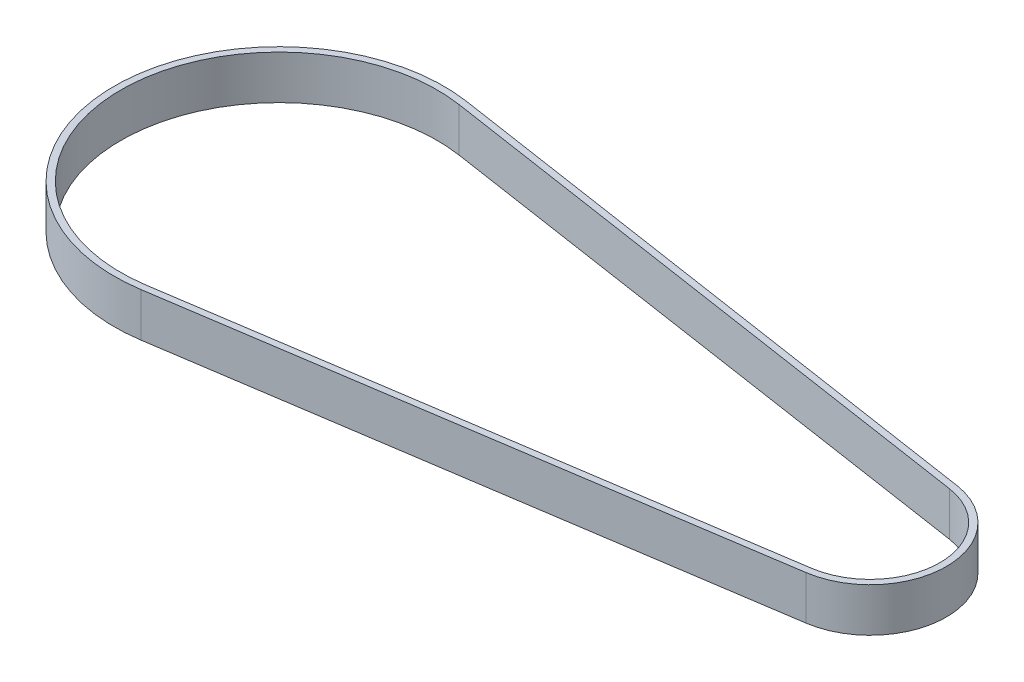
ISO-10303-21;
HEADER;
FILE_DESCRIPTION(('STEP AP214'),'2;1');
FILE_NAME('part.step','',(''),(''),'','','');
FILE_SCHEMA(('AUTOMOTIVE_DESIGN { 1 0 10303 214 1 1 1 1 }'));
ENDSEC;
DATA;
#1=APPLICATION_CONTEXT('core data for automotive mechanical design processes');
#2=APPLICATION_PROTOCOL_DEFINITION('international standard','automotive_design',2000,#1);
#3=PRODUCT_CONTEXT('',#1,'mechanical');
#4=PRODUCT('Part','Part','',(#3));
#5=PRODUCT_RELATED_PRODUCT_CATEGORY('part','',(#4));
#6=PRODUCT_DEFINITION_FORMATION('','',#4);
#7=PRODUCT_DEFINITION_CONTEXT('part definition',#1,'design');
#8=PRODUCT_DEFINITION('design','',#6,#7);
#9=PRODUCT_DEFINITION_SHAPE('','',#8);
#10=(LENGTH_UNIT() NAMED_UNIT(*) SI_UNIT(.MILLI.,.METRE.));
#11=(NAMED_UNIT(*) PLANE_ANGLE_UNIT() SI_UNIT($,.RADIAN.));
#12=(NAMED_UNIT(*) SI_UNIT($,.STERADIAN.) SOLID_ANGLE_UNIT());
#13=UNCERTAINTY_MEASURE_WITH_UNIT(LENGTH_MEASURE(1.E-05),#10,'distance_accuracy_value','');
#14=(GEOMETRIC_REPRESENTATION_CONTEXT(3) GLOBAL_UNCERTAINTY_ASSIGNED_CONTEXT((#13)) GLOBAL_UNIT_ASSIGNED_CONTEXT((#10,
#11,#12)) REPRESENTATION_CONTEXT('',''));
#15=CARTESIAN_POINT('',(0.,0.,0.));
#16=DIRECTION('',(0.,0.,1.));
#17=DIRECTION('',(1.,0.,0.));
#18=AXIS2_PLACEMENT_3D('',#15,#16,#17);
#19=CARTESIAN_POINT('',(-73.987414187643,10.,0.));
#20=DIRECTION('',(0.,1.,0.));
#21=DIRECTION('',(0.,0.,1.));
#22=AXIS2_PLACEMENT_3D('',#19,#20,#21);
#23=PLANE('',#22);
#24=CARTESIAN_POINT('',(-73.987414187643,10.,0.));
#25=DIRECTION('',(0.,1.,0.));
#26=DIRECTION('',(0.,0.,1.));
#27=AXIS2_PLACEMENT_3D('',#24,#25,#26);
#28=CIRCLE('',#27,37.625);
#29=CARTESIAN_POINT('',(-68.3548123357912,10.,-37.2010002738974));
#30=VERTEX_POINT('',#29);
#31=CARTESIAN_POINT('',(-68.3548123357912,10.,37.2010002738974));
#32=VERTEX_POINT('',#31);
#33=EDGE_CURVE('E153',#30,#32,#28,.T.);
#34=ORIENTED_EDGE('',*,*,#33,.T.);
#35=DIRECTION('',(0.988730904289632,0.,-0.149703703703704));
#36=VECTOR('',#35,1.);
#37=CARTESIAN_POINT('',(-68.3548123357912,10.,37.2010002738974));
#38=LINE('',#37,#36);
#39=CARTESIAN_POINT('',(63.619675812357,10.,17.2187486982039));
#40=VERTEX_POINT('',#39);
#41=EDGE_CURVE('E157',#32,#40,#38,.T.);
#42=ORIENTED_EDGE('',*,*,#41,.T.);
#43=CARTESIAN_POINT('',(61.012585812357,10.,0.));
#44=DIRECTION('',(0.,1.,0.));
#45=DIRECTION('',(0.,0.,1.));
#46=AXIS2_PLACEMENT_3D('',#43,#44,#45);
#47=CIRCLE('',#46,17.415);
#48=CARTESIAN_POINT('',(63.619675812357,10.,-17.2187486982039));
#49=VERTEX_POINT('',#48);
#50=EDGE_CURVE('E161',#40,#49,#47,.T.);
#51=ORIENTED_EDGE('',*,*,#50,.T.);
#52=DIRECTION('',(-0.988730904289632,0.,-0.149703703703704));
#53=VECTOR('',#52,1.);
#54=CARTESIAN_POINT('',(-68.3548123357912,10.,-37.2010002738974));
#55=LINE('',#54,#53);
#56=EDGE_CURVE('E164',#49,#30,#55,.T.);
#57=ORIENTED_EDGE('',*,*,#56,.T.);
#58=EDGE_LOOP('',(#34,#42,#51,#57));
#59=FACE_BOUND('',#58,.T.);
#60=DIRECTION('',(0.988730904289632,0.,-0.149703703703704));
#61=VECTOR('',#60,1.);
#62=CARTESIAN_POINT('',(-68.5793678913467,10.,35.7179039174629));
#63=LINE('',#62,#61);
#64=CARTESIAN_POINT('',(-68.5793678913467,10.,35.7179039174629));
#65=VERTEX_POINT('',#64);
#66=CARTESIAN_POINT('',(63.3951202568015,10.,15.7356523417695));
#67=VERTEX_POINT('',#66);
#68=EDGE_CURVE('E114',#65,#67,#63,.T.);
#69=ORIENTED_EDGE('',*,*,#68,.F.);
#70=CARTESIAN_POINT('',(-73.987414187643,10.,0.));
#71=DIRECTION('',(0.,1.,0.));
#72=DIRECTION('',(0.,0.,1.));
#73=AXIS2_PLACEMENT_3D('',#70,#71,#72);
#74=CIRCLE('',#73,36.125);
#75=CARTESIAN_POINT('',(-68.5793678913467,10.,-35.717903917463));
#76=VERTEX_POINT('',#75);
#77=EDGE_CURVE('E105',#76,#65,#74,.T.);
#78=ORIENTED_EDGE('',*,*,#77,.F.);
#79=DIRECTION('',(-0.988730904289632,0.,-0.149703703703704));
#80=VECTOR('',#79,1.);
#81=CARTESIAN_POINT('',(-68.5793678913467,10.,-35.717903917463));
#82=LINE('',#81,#80);
#83=CARTESIAN_POINT('',(63.3951202568014,10.,-15.7356523417695));
#84=VERTEX_POINT('',#83);
#85=EDGE_CURVE('E131',#84,#76,#82,.T.);
#86=ORIENTED_EDGE('',*,*,#85,.F.);
#87=CARTESIAN_POINT('',(61.012585812357,10.,0.));
#88=DIRECTION('',(0.,1.,0.));
#89=DIRECTION('',(0.,0.,1.));
#90=AXIS2_PLACEMENT_3D('',#87,#88,#89);
#91=CIRCLE('',#90,15.915);
#92=EDGE_CURVE('E127',#67,#84,#91,.T.);
#93=ORIENTED_EDGE('',*,*,#92,.F.);
#94=EDGE_LOOP('',(#69,#78,#86,#93));
#95=FACE_BOUND('',#94,.T.);
#96=ADVANCED_FACE('F39',(#59,#95),#23,.T.);
#97=CARTESIAN_POINT('',(-73.987414187643,0.,0.));
#98=DIRECTION('',(0.,1.,0.));
#99=DIRECTION('',(0.,0.,1.));
#100=AXIS2_PLACEMENT_3D('',#97,#98,#99);
#101=PLANE('',#100);
#102=CARTESIAN_POINT('',(-73.987414187643,0.,0.));
#103=DIRECTION('',(0.,1.,0.));
#104=DIRECTION('',(0.,0.,1.));
#105=AXIS2_PLACEMENT_3D('',#102,#103,#104);
#106=CIRCLE('',#105,37.625);
#107=CARTESIAN_POINT('',(-68.3548123357912,0.,-37.2010002738974));
#108=VERTEX_POINT('',#107);
#109=CARTESIAN_POINT('',(-68.3548123357912,0.,37.2010002738974));
#110=VERTEX_POINT('',#109);
#111=EDGE_CURVE('E123',#108,#110,#106,.T.);
#112=ORIENTED_EDGE('',*,*,#111,.F.);
#113=DIRECTION('',(-0.988730904289632,0.,-0.149703703703704));
#114=VECTOR('',#113,1.);
#115=CARTESIAN_POINT('',(-68.3548123357912,0.,-37.2010002738974));
#116=LINE('',#115,#114);
#117=CARTESIAN_POINT('',(63.619675812357,0.,-17.2187486982039));
#118=VERTEX_POINT('',#117);
#119=EDGE_CURVE('E158',#118,#108,#116,.T.);
#120=ORIENTED_EDGE('',*,*,#119,.F.);
#121=CARTESIAN_POINT('',(61.012585812357,0.,0.));
#122=DIRECTION('',(0.,1.,0.));
#123=DIRECTION('',(0.,0.,1.));
#124=AXIS2_PLACEMENT_3D('',#121,#122,#123);
#125=CIRCLE('',#124,17.415);
#126=CARTESIAN_POINT('',(63.619675812357,0.,17.2187486982039));
#127=VERTEX_POINT('',#126);
#128=EDGE_CURVE('E174',#127,#118,#125,.T.);
#129=ORIENTED_EDGE('',*,*,#128,.F.);
#130=DIRECTION('',(0.988730904289632,0.,-0.149703703703704));
#131=VECTOR('',#130,1.);
#132=CARTESIAN_POINT('',(-68.3548123357912,0.,37.2010002738974));
#133=LINE('',#132,#131);
#134=EDGE_CURVE('E171',#110,#127,#133,.T.);
#135=ORIENTED_EDGE('',*,*,#134,.F.);
#136=EDGE_LOOP('',(#112,#120,#129,#135));
#137=FACE_BOUND('',#136,.T.);
#138=CARTESIAN_POINT('',(-73.987414187643,0.,0.));
#139=DIRECTION('',(0.,1.,0.));
#140=DIRECTION('',(0.,0.,1.));
#141=AXIS2_PLACEMENT_3D('',#138,#139,#140);
#142=CIRCLE('',#141,36.125);
#143=CARTESIAN_POINT('',(-68.5793678913467,0.,-35.717903917463));
#144=VERTEX_POINT('',#143);
#145=CARTESIAN_POINT('',(-68.5793678913467,0.,35.7179039174629));
#146=VERTEX_POINT('',#145);
#147=EDGE_CURVE('E63',#144,#146,#142,.T.);
#148=ORIENTED_EDGE('',*,*,#147,.T.);
#149=DIRECTION('',(0.988730904289632,0.,-0.149703703703704));
#150=VECTOR('',#149,1.);
#151=CARTESIAN_POINT('',(-68.5793678913467,0.,35.7179039174629));
#152=LINE('',#151,#150);
#153=CARTESIAN_POINT('',(63.3951202568015,0.,15.7356523417695));
#154=VERTEX_POINT('',#153);
#155=EDGE_CURVE('E121',#146,#154,#152,.T.);
#156=ORIENTED_EDGE('',*,*,#155,.T.);
#157=CARTESIAN_POINT('',(61.012585812357,0.,0.));
#158=DIRECTION('',(0.,1.,0.));
#159=DIRECTION('',(0.,0.,1.));
#160=AXIS2_PLACEMENT_3D('',#157,#158,#159);
#161=CIRCLE('',#160,15.915);
#162=CARTESIAN_POINT('',(63.3951202568015,0.,-15.7356523417695));
#163=VERTEX_POINT('',#162);
#164=EDGE_CURVE('E140',#154,#163,#161,.T.);
#165=ORIENTED_EDGE('',*,*,#164,.T.);
#166=DIRECTION('',(-0.988730904289632,0.,-0.149703703703704));
#167=VECTOR('',#166,1.);
#168=CARTESIAN_POINT('',(-68.5793678913467,0.,-35.717903917463));
#169=LINE('',#168,#167);
#170=EDGE_CURVE('E115',#163,#144,#169,.T.);
#171=ORIENTED_EDGE('',*,*,#170,.T.);
#172=EDGE_LOOP('',(#148,#156,#165,#171));
#173=FACE_BOUND('',#172,.T.);
#174=ADVANCED_FACE('F197',(#137,#173),#101,.F.);
#175=CARTESIAN_POINT('',(-73.987414187643,10.,0.));
#176=DIRECTION('',(0.,-1.,0.));
#177=DIRECTION('',(0.,0.,-1.));
#178=AXIS2_PLACEMENT_3D('',#175,#176,#177);
#179=CYLINDRICAL_SURFACE('',#178,37.625);
#180=ORIENTED_EDGE('',*,*,#111,.T.);
#181=DIRECTION('',(0.,-1.,0.));
#182=VECTOR('',#181,1.);
#183=CARTESIAN_POINT('',(-68.3548123357912,10.,37.2010002738974));
#184=LINE('',#183,#182);
#185=EDGE_CURVE('E11',#32,#110,#184,.T.);
#186=ORIENTED_EDGE('',*,*,#185,.F.);
#187=ORIENTED_EDGE('',*,*,#33,.F.);
#188=DIRECTION('',(0.,-1.,0.));
#189=VECTOR('',#188,1.);
#190=CARTESIAN_POINT('',(-68.3548123357912,10.,-37.2010002738974));
#191=LINE('',#190,#189);
#192=EDGE_CURVE('E167',#30,#108,#191,.T.);
#193=ORIENTED_EDGE('',*,*,#192,.T.);
#194=EDGE_LOOP('',(#180,#186,#187,#193));
#195=FACE_BOUND('',#194,.T.);
#196=ADVANCED_FACE('F41',(#195),#179,.T.);
#197=CARTESIAN_POINT('',(-68.3548123357912,10.,37.2010002738974));
#198=DIRECTION('',(-0.149703703703704,0.,-0.988730904289632));
#199=DIRECTION('',(-0.988730904289632,0.,0.149703703703704));
#200=AXIS2_PLACEMENT_3D('',#197,#198,#199);
#201=PLANE('',#200);
#202=ORIENTED_EDGE('',*,*,#134,.T.);
#203=DIRECTION('',(0.,-1.,0.));
#204=VECTOR('',#203,1.);
#205=CARTESIAN_POINT('',(63.619675812357,10.,17.2187486982039));
#206=LINE('',#205,#204);
#207=EDGE_CURVE('E48',#40,#127,#206,.T.);
#208=ORIENTED_EDGE('',*,*,#207,.F.);
#209=ORIENTED_EDGE('',*,*,#41,.F.);
#210=ORIENTED_EDGE('',*,*,#185,.T.);
#211=EDGE_LOOP('',(#202,#208,#209,#210));
#212=FACE_BOUND('',#211,.T.);
#213=ADVANCED_FACE('F207',(#212),#201,.F.);
#214=CARTESIAN_POINT('',(61.012585812357,10.,0.));
#215=DIRECTION('',(0.,-1.,0.));
#216=DIRECTION('',(0.,0.,-1.));
#217=AXIS2_PLACEMENT_3D('',#214,#215,#216);
#218=CYLINDRICAL_SURFACE('',#217,17.415);
#219=ORIENTED_EDGE('',*,*,#128,.T.);
#220=DIRECTION('',(0.,-1.,0.));
#221=VECTOR('',#220,1.);
#222=CARTESIAN_POINT('',(63.619675812357,10.,-17.2187486982039));
#223=LINE('',#222,#221);
#224=EDGE_CURVE('E182',#49,#118,#223,.T.);
#225=ORIENTED_EDGE('',*,*,#224,.F.);
#226=ORIENTED_EDGE('',*,*,#50,.F.);
#227=ORIENTED_EDGE('',*,*,#207,.T.);
#228=EDGE_LOOP('',(#219,#225,#226,#227));
#229=FACE_BOUND('',#228,.T.);
#230=ADVANCED_FACE('F191',(#229),#218,.T.);
#231=CARTESIAN_POINT('',(-68.3548123357912,10.,-37.2010002738974));
#232=DIRECTION('',(-0.149703703703704,0.,0.988730904289632));
#233=DIRECTION('',(0.988730904289632,0.,0.149703703703704));
#234=AXIS2_PLACEMENT_3D('',#231,#232,#233);
#235=PLANE('',#234);
#236=ORIENTED_EDGE('',*,*,#119,.T.);
#237=ORIENTED_EDGE('',*,*,#192,.F.);
#238=ORIENTED_EDGE('',*,*,#56,.F.);
#239=ORIENTED_EDGE('',*,*,#224,.T.);
#240=EDGE_LOOP('',(#236,#237,#238,#239));
#241=FACE_BOUND('',#240,.T.);
#242=ADVANCED_FACE('F201',(#241),#235,.F.);
#243=CARTESIAN_POINT('',(-73.987414187643,10.,0.));
#244=DIRECTION('',(0.,-1.,0.));
#245=DIRECTION('',(0.,0.,-1.));
#246=AXIS2_PLACEMENT_3D('',#243,#244,#245);
#247=CYLINDRICAL_SURFACE('',#246,36.125);
#248=ORIENTED_EDGE('',*,*,#147,.F.);
#249=DIRECTION('',(0.,-1.,0.));
#250=VECTOR('',#249,1.);
#251=CARTESIAN_POINT('',(-68.5793678913467,10.,-35.717903917463));
#252=LINE('',#251,#250);
#253=EDGE_CURVE('E109',#76,#144,#252,.T.);
#254=ORIENTED_EDGE('',*,*,#253,.F.);
#255=ORIENTED_EDGE('',*,*,#77,.T.);
#256=DIRECTION('',(0.,-1.,0.));
#257=VECTOR('',#256,1.);
#258=CARTESIAN_POINT('',(-68.5793678913467,10.,35.7179039174629));
#259=LINE('',#258,#257);
#260=EDGE_CURVE('E108',#65,#146,#259,.T.);
#261=ORIENTED_EDGE('',*,*,#260,.T.);
#262=EDGE_LOOP('',(#248,#254,#255,#261));
#263=FACE_BOUND('',#262,.T.);
#264=ADVANCED_FACE('F107',(#263),#247,.F.);
#265=CARTESIAN_POINT('',(-68.5793678913467,10.,35.7179039174629));
#266=DIRECTION('',(-0.149703703703704,0.,-0.988730904289632));
#267=DIRECTION('',(-0.988730904289632,0.,0.149703703703704));
#268=AXIS2_PLACEMENT_3D('',#265,#266,#267);
#269=PLANE('',#268);
#270=ORIENTED_EDGE('',*,*,#155,.F.);
#271=ORIENTED_EDGE('',*,*,#260,.F.);
#272=ORIENTED_EDGE('',*,*,#68,.T.);
#273=DIRECTION('',(0.,-1.,0.));
#274=VECTOR('',#273,1.);
#275=CARTESIAN_POINT('',(63.3951202568015,10.,15.7356523417695));
#276=LINE('',#275,#274);
#277=EDGE_CURVE('E124',#67,#154,#276,.T.);
#278=ORIENTED_EDGE('',*,*,#277,.T.);
#279=EDGE_LOOP('',(#270,#271,#272,#278));
#280=FACE_BOUND('',#279,.T.);
#281=ADVANCED_FACE('F118',(#280),#269,.T.);
#282=CARTESIAN_POINT('',(61.012585812357,10.,0.));
#283=DIRECTION('',(0.,-1.,0.));
#284=DIRECTION('',(0.,0.,-1.));
#285=AXIS2_PLACEMENT_3D('',#282,#283,#284);
#286=CYLINDRICAL_SURFACE('',#285,15.915);
#287=ORIENTED_EDGE('',*,*,#164,.F.);
#288=ORIENTED_EDGE('',*,*,#277,.F.);
#289=ORIENTED_EDGE('',*,*,#92,.T.);
#290=DIRECTION('',(0.,-1.,0.));
#291=VECTOR('',#290,1.);
#292=CARTESIAN_POINT('',(63.3951202568015,10.,-15.7356523417695));
#293=LINE('',#292,#291);
#294=EDGE_CURVE('E55',#84,#163,#293,.T.);
#295=ORIENTED_EDGE('',*,*,#294,.T.);
#296=EDGE_LOOP('',(#287,#288,#289,#295));
#297=FACE_BOUND('',#296,.T.);
#298=ADVANCED_FACE('F230',(#297),#286,.F.);
#299=CARTESIAN_POINT('',(-68.5793678913467,10.,-35.717903917463));
#300=DIRECTION('',(-0.149703703703704,0.,0.988730904289632));
#301=DIRECTION('',(0.988730904289632,0.,0.149703703703704));
#302=AXIS2_PLACEMENT_3D('',#299,#300,#301);
#303=PLANE('',#302);
#304=ORIENTED_EDGE('',*,*,#170,.F.);
#305=ORIENTED_EDGE('',*,*,#294,.F.);
#306=ORIENTED_EDGE('',*,*,#85,.T.);
#307=ORIENTED_EDGE('',*,*,#253,.T.);
#308=EDGE_LOOP('',(#304,#305,#306,#307));
#309=FACE_BOUND('',#308,.T.);
#310=ADVANCED_FACE('F234',(#309),#303,.T.);
#311=CLOSED_SHELL('',(#96,#174,#196,#213,#230,#242,#264,#281,#298,#310));
#312=MANIFOLD_SOLID_BREP('B2',#311);
#313=ADVANCED_BREP_SHAPE_REPRESENTATION('',(#18,#312),#14);
#314=SHAPE_DEFINITION_REPRESENTATION(#9,#313);
ENDSEC;
END-ISO-10303-21;
